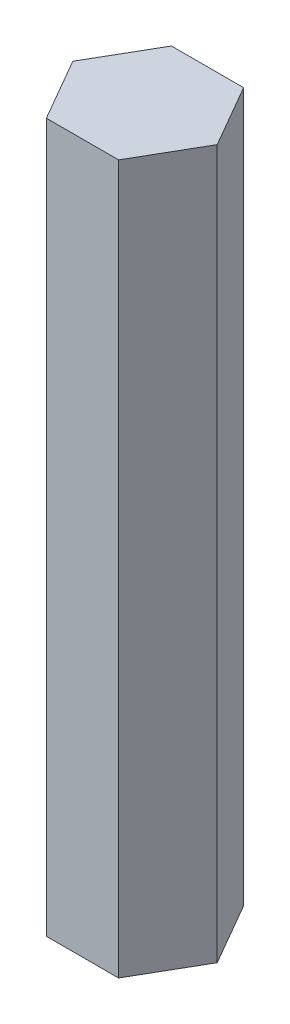
ISO-10303-21;
HEADER;
FILE_DESCRIPTION(('STEP AP214'),'2;1');
FILE_NAME('part.step','',(''),(''),'','','');
FILE_SCHEMA(('AUTOMOTIVE_DESIGN { 1 0 10303 214 1 1 1 1 }'));
ENDSEC;
DATA;
#1=APPLICATION_CONTEXT('core data for automotive mechanical design processes');
#2=APPLICATION_PROTOCOL_DEFINITION('international standard','automotive_design',2000,#1);
#3=PRODUCT_CONTEXT('',#1,'mechanical');
#4=PRODUCT('Part','Part','',(#3));
#5=PRODUCT_RELATED_PRODUCT_CATEGORY('part','',(#4));
#6=PRODUCT_DEFINITION_FORMATION('','',#4);
#7=PRODUCT_DEFINITION_CONTEXT('part definition',#1,'design');
#8=PRODUCT_DEFINITION('design','',#6,#7);
#9=PRODUCT_DEFINITION_SHAPE('','',#8);
#10=(LENGTH_UNIT() NAMED_UNIT(*) SI_UNIT(.MILLI.,.METRE.));
#11=(NAMED_UNIT(*) PLANE_ANGLE_UNIT() SI_UNIT($,.RADIAN.));
#12=(NAMED_UNIT(*) SI_UNIT($,.STERADIAN.) SOLID_ANGLE_UNIT());
#13=UNCERTAINTY_MEASURE_WITH_UNIT(LENGTH_MEASURE(1.E-05),#10,'distance_accuracy_value','');
#14=(GEOMETRIC_REPRESENTATION_CONTEXT(3) GLOBAL_UNCERTAINTY_ASSIGNED_CONTEXT((#13)) GLOBAL_UNIT_ASSIGNED_CONTEXT((#10,
#11,#12)) REPRESENTATION_CONTEXT('',''));
#15=CARTESIAN_POINT('',(0.,0.,0.));
#16=DIRECTION('',(0.,0.,1.));
#17=DIRECTION('',(1.,0.,0.));
#18=AXIS2_PLACEMENT_3D('',#15,#16,#17);
#19=CARTESIAN_POINT('',(3.6661742093542,71.9582,6.34999999999996));
#20=DIRECTION('',(-0.866025403784442,0.,-0.499999999999995));
#21=DIRECTION('',(-0.499999999999995,0.,0.866025403784442));
#22=AXIS2_PLACEMENT_3D('',#19,#20,#21);
#23=PLANE('',#22);
#24=DIRECTION('',(0.499999999999995,0.,-0.866025403784442));
#25=VECTOR('',#24,1.);
#26=CARTESIAN_POINT('',(3.6661742093542,0.,6.34999999999996));
#27=LINE('',#26,#25);
#28=CARTESIAN_POINT('',(3.6661742093542,0.,6.34999999999996));
#29=VERTEX_POINT('',#28);
#30=CARTESIAN_POINT('',(7.33234841870825,0.,0.));
#31=VERTEX_POINT('',#30);
#32=EDGE_CURVE('E116',#29,#31,#27,.T.);
#33=ORIENTED_EDGE('',*,*,#32,.T.);
#34=DIRECTION('',(0.,-1.,0.));
#35=VECTOR('',#34,1.);
#36=CARTESIAN_POINT('',(7.33234841870825,71.9582,0.));
#37=LINE('',#36,#35);
#38=CARTESIAN_POINT('',(7.33234841870825,71.9582,0.));
#39=VERTEX_POINT('',#38);
#40=EDGE_CURVE('E11',#39,#31,#37,.T.);
#41=ORIENTED_EDGE('',*,*,#40,.F.);
#42=DIRECTION('',(0.499999999999995,0.,-0.866025403784442));
#43=VECTOR('',#42,1.);
#44=CARTESIAN_POINT('',(3.6661742093542,71.9582,6.34999999999996));
#45=LINE('',#44,#43);
#46=CARTESIAN_POINT('',(3.6661742093542,71.9582,6.34999999999996));
#47=VERTEX_POINT('',#46);
#48=EDGE_CURVE('E126',#47,#39,#45,.T.);
#49=ORIENTED_EDGE('',*,*,#48,.F.);
#50=DIRECTION('',(0.,-1.,0.));
#51=VECTOR('',#50,1.);
#52=CARTESIAN_POINT('',(3.6661742093542,71.9582,6.34999999999996));
#53=LINE('',#52,#51);
#54=EDGE_CURVE('E112',#47,#29,#53,.T.);
#55=ORIENTED_EDGE('',*,*,#54,.T.);
#56=EDGE_LOOP('',(#33,#41,#49,#55));
#57=FACE_BOUND('',#56,.T.);
#58=ADVANCED_FACE('F32',(#57),#23,.F.);
#59=CARTESIAN_POINT('',(7.33234841870825,71.9582,0.));
#60=DIRECTION('',(-0.866025403784438,0.,0.500000000000001));
#61=DIRECTION('',(0.500000000000001,0.,0.866025403784438));
#62=AXIS2_PLACEMENT_3D('',#59,#60,#61);
#63=PLANE('',#62);
#64=DIRECTION('',(-0.500000000000001,0.,-0.866025403784438));
#65=VECTOR('',#64,1.);
#66=CARTESIAN_POINT('',(7.33234841870825,0.,0.));
#67=LINE('',#66,#65);
#68=CARTESIAN_POINT('',(3.66617420935411,0.,-6.35000000000001));
#69=VERTEX_POINT('',#68);
#70=EDGE_CURVE('E119',#31,#69,#67,.T.);
#71=ORIENTED_EDGE('',*,*,#70,.T.);
#72=DIRECTION('',(0.,-1.,0.));
#73=VECTOR('',#72,1.);
#74=CARTESIAN_POINT('',(3.66617420935411,71.9582,-6.35000000000001));
#75=LINE('',#74,#73);
#76=CARTESIAN_POINT('',(3.66617420935411,71.9582,-6.35000000000001));
#77=VERTEX_POINT('',#76);
#78=EDGE_CURVE('E40',#77,#69,#75,.T.);
#79=ORIENTED_EDGE('',*,*,#78,.F.);
#80=DIRECTION('',(-0.500000000000001,0.,-0.866025403784438));
#81=VECTOR('',#80,1.);
#82=CARTESIAN_POINT('',(7.33234841870825,71.9582,0.));
#83=LINE('',#82,#81);
#84=EDGE_CURVE('E85',#39,#77,#83,.T.);
#85=ORIENTED_EDGE('',*,*,#84,.F.);
#86=ORIENTED_EDGE('',*,*,#40,.T.);
#87=EDGE_LOOP('',(#71,#79,#85,#86));
#88=FACE_BOUND('',#87,.T.);
#89=ADVANCED_FACE('F150',(#88),#63,.F.);
#90=CARTESIAN_POINT('',(3.66617420935411,71.9582,-6.35000000000001));
#91=DIRECTION('',(0.,0.,1.));
#92=DIRECTION('',(1.,0.,0.));
#93=AXIS2_PLACEMENT_3D('',#90,#91,#92);
#94=PLANE('',#93);
#95=DIRECTION('',(-1.,0.,0.));
#96=VECTOR('',#95,1.);
#97=CARTESIAN_POINT('',(3.66617420935411,0.,-6.35000000000001));
#98=LINE('',#97,#96);
#99=CARTESIAN_POINT('',(-3.66617420935416,0.,-6.34999999999999));
#100=VERTEX_POINT('',#99);
#101=EDGE_CURVE('E121',#69,#100,#98,.T.);
#102=ORIENTED_EDGE('',*,*,#101,.T.);
#103=DIRECTION('',(0.,-1.,0.));
#104=VECTOR('',#103,1.);
#105=CARTESIAN_POINT('',(-3.66617420935416,71.9582,-6.34999999999999));
#106=LINE('',#105,#104);
#107=CARTESIAN_POINT('',(-3.66617420935416,71.9582,-6.34999999999999));
#108=VERTEX_POINT('',#107);
#109=EDGE_CURVE('E107',#108,#100,#106,.T.);
#110=ORIENTED_EDGE('',*,*,#109,.F.);
#111=DIRECTION('',(-1.,0.,0.));
#112=VECTOR('',#111,1.);
#113=CARTESIAN_POINT('',(3.66617420935411,71.9582,-6.35000000000001));
#114=LINE('',#113,#112);
#115=EDGE_CURVE('E98',#77,#108,#114,.T.);
#116=ORIENTED_EDGE('',*,*,#115,.F.);
#117=ORIENTED_EDGE('',*,*,#78,.T.);
#118=EDGE_LOOP('',(#102,#110,#116,#117));
#119=FACE_BOUND('',#118,.T.);
#120=ADVANCED_FACE('F132',(#119),#94,.F.);
#121=CARTESIAN_POINT('',(-3.66617420935416,71.9582,-6.34999999999999));
#122=DIRECTION('',(0.866025403784442,0.,0.499999999999995));
#123=DIRECTION('',(0.499999999999995,0.,-0.866025403784442));
#124=AXIS2_PLACEMENT_3D('',#121,#122,#123);
#125=PLANE('',#124);
#126=DIRECTION('',(-0.499999999999995,0.,0.866025403784442));
#127=VECTOR('',#126,1.);
#128=CARTESIAN_POINT('',(-3.66617420935416,0.,-6.34999999999999));
#129=LINE('',#128,#127);
#130=CARTESIAN_POINT('',(-7.33234841870825,0.,0.));
#131=VERTEX_POINT('',#130);
#132=EDGE_CURVE('E106',#100,#131,#129,.T.);
#133=ORIENTED_EDGE('',*,*,#132,.T.);
#134=DIRECTION('',(0.,-1.,0.));
#135=VECTOR('',#134,1.);
#136=CARTESIAN_POINT('',(-7.33234841870825,71.9582,0.));
#137=LINE('',#136,#135);
#138=CARTESIAN_POINT('',(-7.33234841870825,71.9582,0.));
#139=VERTEX_POINT('',#138);
#140=EDGE_CURVE('E103',#139,#131,#137,.T.);
#141=ORIENTED_EDGE('',*,*,#140,.F.);
#142=DIRECTION('',(-0.499999999999995,0.,0.866025403784442));
#143=VECTOR('',#142,1.);
#144=CARTESIAN_POINT('',(-3.66617420935416,71.9582,-6.34999999999999));
#145=LINE('',#144,#143);
#146=EDGE_CURVE('E92',#108,#139,#145,.T.);
#147=ORIENTED_EDGE('',*,*,#146,.F.);
#148=ORIENTED_EDGE('',*,*,#109,.T.);
#149=EDGE_LOOP('',(#133,#141,#147,#148));
#150=FACE_BOUND('',#149,.T.);
#151=ADVANCED_FACE('F104',(#150),#125,.F.);
#152=CARTESIAN_POINT('',(-7.33234841870825,71.9582,0.));
#153=DIRECTION('',(0.866025403784434,0.,-0.500000000000007));
#154=DIRECTION('',(-0.500000000000007,0.,-0.866025403784434));
#155=AXIS2_PLACEMENT_3D('',#152,#153,#154);
#156=PLANE('',#155);
#157=DIRECTION('',(0.500000000000007,0.,0.866025403784434));
#158=VECTOR('',#157,1.);
#159=CARTESIAN_POINT('',(-7.33234841870825,0.,0.));
#160=LINE('',#159,#158);
#161=CARTESIAN_POINT('',(-3.66617420935407,0.,6.35000000000004));
#162=VERTEX_POINT('',#161);
#163=EDGE_CURVE('E71',#131,#162,#160,.T.);
#164=ORIENTED_EDGE('',*,*,#163,.T.);
#165=DIRECTION('',(0.,-1.,0.));
#166=VECTOR('',#165,1.);
#167=CARTESIAN_POINT('',(-3.66617420935407,71.9582,6.35000000000004));
#168=LINE('',#167,#166);
#169=CARTESIAN_POINT('',(-3.66617420935407,71.9582,6.35000000000004));
#170=VERTEX_POINT('',#169);
#171=EDGE_CURVE('E108',#170,#162,#168,.T.);
#172=ORIENTED_EDGE('',*,*,#171,.F.);
#173=DIRECTION('',(0.500000000000007,0.,0.866025403784434));
#174=VECTOR('',#173,1.);
#175=CARTESIAN_POINT('',(-7.33234841870825,71.9582,0.));
#176=LINE('',#175,#174);
#177=EDGE_CURVE('E96',#139,#170,#176,.T.);
#178=ORIENTED_EDGE('',*,*,#177,.F.);
#179=ORIENTED_EDGE('',*,*,#140,.T.);
#180=EDGE_LOOP('',(#164,#172,#178,#179));
#181=FACE_BOUND('',#180,.T.);
#182=ADVANCED_FACE('F110',(#181),#156,.F.);
#183=CARTESIAN_POINT('',(-3.66617420935407,71.9582,6.35000000000004));
#184=DIRECTION('',(0.,0.,-1.));
#185=DIRECTION('',(-1.,0.,0.));
#186=AXIS2_PLACEMENT_3D('',#183,#184,#185);
#187=PLANE('',#186);
#188=DIRECTION('',(1.,0.,0.));
#189=VECTOR('',#188,1.);
#190=CARTESIAN_POINT('',(-3.66617420935407,0.,6.35000000000004));
#191=LINE('',#190,#189);
#192=EDGE_CURVE('E77',#162,#29,#191,.T.);
#193=ORIENTED_EDGE('',*,*,#192,.T.);
#194=ORIENTED_EDGE('',*,*,#54,.F.);
#195=DIRECTION('',(1.,0.,0.));
#196=VECTOR('',#195,1.);
#197=CARTESIAN_POINT('',(-3.66617420935407,71.9582,6.35000000000004));
#198=LINE('',#197,#196);
#199=EDGE_CURVE('E48',#170,#47,#198,.T.);
#200=ORIENTED_EDGE('',*,*,#199,.F.);
#201=ORIENTED_EDGE('',*,*,#171,.T.);
#202=EDGE_LOOP('',(#193,#194,#200,#201));
#203=FACE_BOUND('',#202,.T.);
#204=ADVANCED_FACE('F139',(#203),#187,.F.);
#205=CARTESIAN_POINT('',(0.,71.9582,0.));
#206=DIRECTION('',(0.,1.,0.));
#207=DIRECTION('',(0.,0.,1.));
#208=AXIS2_PLACEMENT_3D('',#205,#206,#207);
#209=PLANE('',#208);
#210=ORIENTED_EDGE('',*,*,#48,.T.);
#211=ORIENTED_EDGE('',*,*,#84,.T.);
#212=ORIENTED_EDGE('',*,*,#115,.T.);
#213=ORIENTED_EDGE('',*,*,#146,.T.);
#214=ORIENTED_EDGE('',*,*,#177,.T.);
#215=ORIENTED_EDGE('',*,*,#199,.T.);
#216=EDGE_LOOP('',(#210,#211,#212,#213,#214,#215));
#217=FACE_BOUND('',#216,.T.);
#218=ADVANCED_FACE('F94',(#217),#209,.T.);
#219=CARTESIAN_POINT('',(0.,0.,0.));
#220=DIRECTION('',(0.,1.,0.));
#221=DIRECTION('',(0.,0.,1.));
#222=AXIS2_PLACEMENT_3D('',#219,#220,#221);
#223=PLANE('',#222);
#224=ORIENTED_EDGE('',*,*,#32,.F.);
#225=ORIENTED_EDGE('',*,*,#192,.F.);
#226=ORIENTED_EDGE('',*,*,#163,.F.);
#227=ORIENTED_EDGE('',*,*,#132,.F.);
#228=ORIENTED_EDGE('',*,*,#101,.F.);
#229=ORIENTED_EDGE('',*,*,#70,.F.);
#230=EDGE_LOOP('',(#224,#225,#226,#227,#228,#229));
#231=FACE_BOUND('',#230,.T.);
#232=ADVANCED_FACE('F135',(#231),#223,.F.);
#233=CLOSED_SHELL('',(#58,#89,#120,#151,#182,#204,#218,#232));
#234=MANIFOLD_SOLID_BREP('B2',#233);
#235=ADVANCED_BREP_SHAPE_REPRESENTATION('',(#18,#234),#14);
#236=SHAPE_DEFINITION_REPRESENTATION(#9,#235);
ENDSEC;
END-ISO-10303-21;
